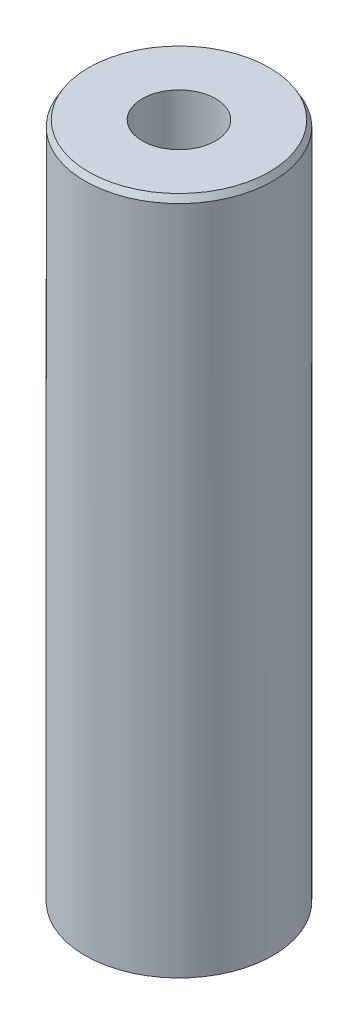
ISO-10303-21;
HEADER;
FILE_DESCRIPTION(('STEP AP214'),'2;1');
FILE_NAME('part.step','',(''),(''),'','','');
FILE_SCHEMA(('AUTOMOTIVE_DESIGN { 1 0 10303 214 1 1 1 1 }'));
ENDSEC;
DATA;
#1=APPLICATION_CONTEXT('core data for automotive mechanical design processes');
#2=APPLICATION_PROTOCOL_DEFINITION('international standard','automotive_design',2000,#1);
#3=PRODUCT_CONTEXT('',#1,'mechanical');
#4=PRODUCT('Part','Part','',(#3));
#5=PRODUCT_RELATED_PRODUCT_CATEGORY('part','',(#4));
#6=PRODUCT_DEFINITION_FORMATION('','',#4);
#7=PRODUCT_DEFINITION_CONTEXT('part definition',#1,'design');
#8=PRODUCT_DEFINITION('design','',#6,#7);
#9=PRODUCT_DEFINITION_SHAPE('','',#8);
#10=(LENGTH_UNIT() NAMED_UNIT(*) SI_UNIT(.MILLI.,.METRE.));
#11=(NAMED_UNIT(*) PLANE_ANGLE_UNIT() SI_UNIT($,.RADIAN.));
#12=(NAMED_UNIT(*) SI_UNIT($,.STERADIAN.) SOLID_ANGLE_UNIT());
#13=UNCERTAINTY_MEASURE_WITH_UNIT(LENGTH_MEASURE(1.E-05),#10,'distance_accuracy_value','');
#14=(GEOMETRIC_REPRESENTATION_CONTEXT(3) GLOBAL_UNCERTAINTY_ASSIGNED_CONTEXT((#13)) GLOBAL_UNIT_ASSIGNED_CONTEXT((#10,
#11,#12)) REPRESENTATION_CONTEXT('',''));
#15=CARTESIAN_POINT('',(0.,0.,0.));
#16=DIRECTION('',(0.,0.,1.));
#17=DIRECTION('',(1.,0.,0.));
#18=AXIS2_PLACEMENT_3D('',#15,#16,#17);
#19=CARTESIAN_POINT('',(0.,181.106623515309,0.));
#20=DIRECTION('',(0.,-1.,0.));
#21=DIRECTION('',(0.,0.,-1.));
#22=AXIS2_PLACEMENT_3D('',#19,#20,#21);
#23=CYLINDRICAL_SURFACE('',#22,25.);
#24=CARTESIAN_POINT('',(0.,179.458389998417,0.));
#25=DIRECTION('',(0.,1.,0.));
#26=DIRECTION('',(0.,0.,1.));
#27=AXIS2_PLACEMENT_3D('',#24,#25,#26);
#28=CIRCLE('',#27,25.);
#29=CARTESIAN_POINT('',(0.,179.458389998417,-25.));
#30=VERTEX_POINT('',#29);
#31=EDGE_CURVE('E50',#30,#30,#28,.F.);
#32=CARTESIAN_POINT('',(0.,0.951608064665238,0.));
#33=DIRECTION('',(0.,1.,0.));
#34=DIRECTION('',(0.,0.,1.));
#35=AXIS2_PLACEMENT_3D('',#32,#33,#34);
#36=CIRCLE('',#35,25.);
#37=CARTESIAN_POINT('',(0.,0.951608064665238,-25.));
#38=VERTEX_POINT('',#37);
#39=EDGE_CURVE('E51',#38,#38,#36,.T.);
#40=CARTESIAN_POINT('',(0.,179.458389998417,-25.));
#41=CARTESIAN_POINT('',(0.,177.598944353274,-25.));
#42=CARTESIAN_POINT('',(0.,175.739498708131,-25.));
#43=CARTESIAN_POINT('',(0.,172.020607417844,-25.));
#44=CARTESIAN_POINT('',(0.,170.161161772701,-25.));
#45=CARTESIAN_POINT('',(0.,166.442270482414,-25.));
#46=CARTESIAN_POINT('',(0.,164.582824837271,-25.));
#47=CARTESIAN_POINT('',(0.,160.863933546985,-25.));
#48=CARTESIAN_POINT('',(0.,159.004487901841,-25.));
#49=CARTESIAN_POINT('',(0.,155.285596611555,-25.));
#50=CARTESIAN_POINT('',(0.,153.426150966412,-25.));
#51=CARTESIAN_POINT('',(0.,149.707259676125,-25.));
#52=CARTESIAN_POINT('',(0.,147.847814030982,-25.));
#53=CARTESIAN_POINT('',(0.,144.128922740695,-25.));
#54=CARTESIAN_POINT('',(0.,142.269477095552,-25.));
#55=CARTESIAN_POINT('',(0.,138.550585805266,-25.));
#56=CARTESIAN_POINT('',(0.,136.691140160122,-25.));
#57=CARTESIAN_POINT('',(0.,132.972248869836,-25.));
#58=CARTESIAN_POINT('',(0.,131.112803224693,-25.));
#59=CARTESIAN_POINT('',(0.,127.393911934406,-25.));
#60=CARTESIAN_POINT('',(0.,125.534466289263,-25.));
#61=CARTESIAN_POINT('',(0.,121.815574998976,-25.));
#62=CARTESIAN_POINT('',(0.,119.956129353833,-25.));
#63=CARTESIAN_POINT('',(0.,116.237238063547,-25.));
#64=CARTESIAN_POINT('',(0.,114.377792418403,-25.));
#65=CARTESIAN_POINT('',(0.,110.658901128117,-25.));
#66=CARTESIAN_POINT('',(0.,108.799455482974,-25.));
#67=CARTESIAN_POINT('',(0.,105.080564192687,-25.));
#68=CARTESIAN_POINT('',(0.,103.221118547544,-25.));
#69=CARTESIAN_POINT('',(0.,99.5022272572574,-25.));
#70=CARTESIAN_POINT('',(0.,97.6427816121142,-25.));
#71=CARTESIAN_POINT('',(0.,93.9238903218277,-25.));
#72=CARTESIAN_POINT('',(0.,92.0644446766844,-25.));
#73=CARTESIAN_POINT('',(0.,88.3455533863979,-25.));
#74=CARTESIAN_POINT('',(0.,86.4861077412547,-25.));
#75=CARTESIAN_POINT('',(0.,82.7672164509682,-25.));
#76=CARTESIAN_POINT('',(0.,80.9077708058249,-25.));
#77=CARTESIAN_POINT('',(0.,77.1888795155384,-25.));
#78=CARTESIAN_POINT('',(0.,75.3294338703952,-25.));
#79=CARTESIAN_POINT('',(0.,71.6105425801087,-25.));
#80=CARTESIAN_POINT('',(0.,69.7510969349654,-25.));
#81=CARTESIAN_POINT('',(0.,66.0322056446789,-25.));
#82=CARTESIAN_POINT('',(0.,64.1727599995357,-25.));
#83=CARTESIAN_POINT('',(0.,60.4538687092492,-25.));
#84=CARTESIAN_POINT('',(0.,58.5944230641059,-25.));
#85=CARTESIAN_POINT('',(0.,54.8755317738194,-25.));
#86=CARTESIAN_POINT('',(0.,53.0160861286762,-25.));
#87=CARTESIAN_POINT('',(0.,49.2971948383897,-25.));
#88=CARTESIAN_POINT('',(0.,47.4377491932464,-25.));
#89=CARTESIAN_POINT('',(0.,43.71885790296,-25.));
#90=CARTESIAN_POINT('',(0.,41.8594122578167,-25.));
#91=CARTESIAN_POINT('',(0.,38.1405209675302,-25.));
#92=CARTESIAN_POINT('',(0.,36.281075322387,-25.));
#93=CARTESIAN_POINT('',(0.,32.5621840321005,-25.));
#94=CARTESIAN_POINT('',(0.,30.7027383869572,-25.));
#95=CARTESIAN_POINT('',(0.,26.9838470966707,-25.));
#96=CARTESIAN_POINT('',(0.,25.1244014515275,-25.));
#97=CARTESIAN_POINT('',(0.,21.405510161241,-25.));
#98=CARTESIAN_POINT('',(0.,19.5460645160977,-25.));
#99=CARTESIAN_POINT('',(0.,15.8271732258112,-25.));
#100=CARTESIAN_POINT('',(0.,13.967727580668,-25.));
#101=CARTESIAN_POINT('',(0.,10.2488362903815,-25.));
#102=CARTESIAN_POINT('',(0.,8.38939064523824,-25.));
#103=CARTESIAN_POINT('',(0.,4.67049935495174,-25.));
#104=CARTESIAN_POINT('',(0.,2.81105370980849,-25.));
#105=CARTESIAN_POINT('',(0.,0.951608064665238,-25.));
#106=B_SPLINE_CURVE_WITH_KNOTS('',3,(#40,#41,#42,#43,#44,#45,#46,#47,#48,#49,#50,#51,#52,#53,
#54,#55,#56,#57,#58,#59,#60,#61,#62,#63,#64,#65,#66,#67,#68,#69,#70,#71,#72,#73,#74,#75,#76,#77,
#78,#79,#80,#81,#82,#83,#84,#85,#86,#87,#88,#89,#90,#91,#92,#93,#94,#95,#96,#97,#98,#99,#100,
#101,#102,#103,#104,#105),.UNSPECIFIED.,.F.,.F.,(4,2,2,2,2,2,2,2,2,2,2,2,2,2,2,2,2,2,2,2,2,2,2,
2,2,2,2,2,2,2,2,2,4),(0.,5.57833693542975,11.1566738708595,16.7350108062893,22.313347741719,
27.8916846771487,33.4700216125785,39.0483585480082,44.626695483438,50.2050324188677,
55.7833693542974,61.3617062897272,66.940043225157,72.5183801605867,78.0967170960164,
83.6750540314462,89.2533909668759,94.8317279023057,100.410064837735,105.988401773165,
111.566738708595,117.145075644025,122.723412579454,128.301749514884,133.880086450314,
139.458423385744,145.036760321173,150.615097256603,156.193434192033,161.771771127463,
167.350108062892,172.928444998322,178.506781933752),.UNSPECIFIED.);
#107=EDGE_CURVE('BSEAM39',#30,#38,#106,.T.);
#108=ORIENTED_EDGE('',*,*,#31,.T.);
#109=ORIENTED_EDGE('',*,*,#39,.T.);
#110=ORIENTED_EDGE('',*,*,#107,.T.);
#111=ORIENTED_EDGE('',*,*,#107,.F.);
#112=EDGE_LOOP('',(#108,#110,#109,#111));
#113=FACE_BOUND('',#112,.T.);
#114=ADVANCED_FACE('F39',(#113),#23,.T.);
#115=CARTESIAN_POINT('',(0.,181.106623515309,0.));
#116=DIRECTION('',(0.,1.,0.));
#117=DIRECTION('',(0.,0.,1.));
#118=AXIS2_PLACEMENT_3D('',#115,#116,#117);
#119=PLANE('',#118);
#120=CARTESIAN_POINT('',(0.,181.106623515309,0.));
#121=DIRECTION('',(0.,1.,0.));
#122=DIRECTION('',(0.,0.,1.));
#123=AXIS2_PLACEMENT_3D('',#120,#121,#122);
#124=CIRCLE('',#123,24.0483919353349);
#125=CARTESIAN_POINT('',(0.,181.106623515309,24.0483919353349));
#126=VERTEX_POINT('',#125);
#127=EDGE_CURVE('E54',#126,#126,#124,.T.);
#128=ORIENTED_EDGE('',*,*,#127,.T.);
#129=EDGE_LOOP('',(#128));
#130=FACE_BOUND('',#129,.T.);
#131=CARTESIAN_POINT('',(0.,181.106623515309,0.));
#132=DIRECTION('',(0.,1.,0.));
#133=DIRECTION('',(0.,0.,1.));
#134=AXIS2_PLACEMENT_3D('',#131,#132,#133);
#135=CIRCLE('',#134,9.75354512604374);
#136=CARTESIAN_POINT('',(0.,181.106623515309,-9.75354512604374));
#137=VERTEX_POINT('',#136);
#138=EDGE_CURVE('E58',#137,#137,#135,.T.);
#139=ORIENTED_EDGE('',*,*,#138,.F.);
#140=EDGE_LOOP('',(#139));
#141=FACE_BOUND('',#140,.T.);
#142=ADVANCED_FACE('F69',(#130,#141),#119,.T.);
#143=CARTESIAN_POINT('',(0.,0.,0.));
#144=DIRECTION('',(0.,1.,0.));
#145=DIRECTION('',(0.,0.,1.));
#146=AXIS2_PLACEMENT_3D('',#143,#144,#145);
#147=PLANE('',#146);
#148=CARTESIAN_POINT('',(0.,0.,0.));
#149=DIRECTION('',(0.,1.,0.));
#150=DIRECTION('',(0.,0.,1.));
#151=AXIS2_PLACEMENT_3D('',#148,#149,#150);
#152=CIRCLE('',#151,23.3517664831075);
#153=CARTESIAN_POINT('',(0.,0.,23.3517664831075));
#154=VERTEX_POINT('',#153);
#155=EDGE_CURVE('E10',#154,#154,#152,.F.);
#156=ORIENTED_EDGE('',*,*,#155,.T.);
#157=EDGE_LOOP('',(#156));
#158=FACE_BOUND('',#157,.T.);
#159=CARTESIAN_POINT('',(0.,0.,0.));
#160=DIRECTION('',(0.,1.,0.));
#161=DIRECTION('',(0.,0.,1.));
#162=AXIS2_PLACEMENT_3D('',#159,#160,#161);
#163=CIRCLE('',#162,9.75354512604374);
#164=CARTESIAN_POINT('',(0.,0.,-9.75354512604374));
#165=VERTEX_POINT('',#164);
#166=EDGE_CURVE('E63',#165,#165,#163,.T.);
#167=ORIENTED_EDGE('',*,*,#166,.T.);
#168=EDGE_LOOP('',(#167));
#169=FACE_BOUND('',#168,.T.);
#170=ADVANCED_FACE('F75',(#158,#169),#147,.F.);
#171=CARTESIAN_POINT('',(0.,181.106623515309,0.));
#172=DIRECTION('',(0.,-1.,0.));
#173=DIRECTION('',(0.,0.,-1.));
#174=AXIS2_PLACEMENT_3D('',#171,#172,#173);
#175=CYLINDRICAL_SURFACE('',#174,9.75354512604374);
#176=CARTESIAN_POINT('',(0.,181.106623515309,-9.75354512604374));
#177=CARTESIAN_POINT('',(0.,179.220096187025,-9.75354512604374));
#178=CARTESIAN_POINT('',(0.,177.33356885874,-9.75354512604374));
#179=CARTESIAN_POINT('',(0.,173.560514202171,-9.75354512604374));
#180=CARTESIAN_POINT('',(0.,171.673986873887,-9.75354512604374));
#181=CARTESIAN_POINT('',(0.,167.900932217318,-9.75354512604374));
#182=CARTESIAN_POINT('',(0.,166.014404889034,-9.75354512604374));
#183=CARTESIAN_POINT('',(0.,162.241350232465,-9.75354512604374));
#184=CARTESIAN_POINT('',(0.,160.35482290418,-9.75354512604374));
#185=CARTESIAN_POINT('',(0.,156.581768247611,-9.75354512604374));
#186=CARTESIAN_POINT('',(0.,154.695240919327,-9.75354512604374));
#187=CARTESIAN_POINT('',(0.,150.922186262758,-9.75354512604374));
#188=CARTESIAN_POINT('',(0.,149.035658934473,-9.75354512604374));
#189=CARTESIAN_POINT('',(0.,145.262604277904,-9.75354512604374));
#190=CARTESIAN_POINT('',(0.,143.37607694962,-9.75354512604374));
#191=CARTESIAN_POINT('',(0.,139.603022293051,-9.75354512604374));
#192=CARTESIAN_POINT('',(0.,137.716494964766,-9.75354512604374));
#193=CARTESIAN_POINT('',(0.,133.943440308197,-9.75354512604374));
#194=CARTESIAN_POINT('',(0.,132.056912979913,-9.75354512604374));
#195=CARTESIAN_POINT('',(0.,128.283858323344,-9.75354512604374));
#196=CARTESIAN_POINT('',(0.,126.39733099506,-9.75354512604374));
#197=CARTESIAN_POINT('',(0.,122.624276338491,-9.75354512604374));
#198=CARTESIAN_POINT('',(0.,120.737749010206,-9.75354512604374));
#199=CARTESIAN_POINT('',(0.,116.964694353637,-9.75354512604374));
#200=CARTESIAN_POINT('',(0.,115.078167025353,-9.75354512604374));
#201=CARTESIAN_POINT('',(0.,111.305112368784,-9.75354512604374));
#202=CARTESIAN_POINT('',(0.,109.418585040499,-9.75354512604374));
#203=CARTESIAN_POINT('',(0.,105.64553038393,-9.75354512604374));
#204=CARTESIAN_POINT('',(0.,103.759003055646,-9.75354512604374));
#205=CARTESIAN_POINT('',(0.,99.985948399077,-9.75354512604374));
#206=CARTESIAN_POINT('',(0.,98.0994210707925,-9.75354512604374));
#207=CARTESIAN_POINT('',(0.,94.3263664142236,-9.75354512604374));
#208=CARTESIAN_POINT('',(0.,92.4398390859391,-9.75354512604374));
#209=CARTESIAN_POINT('',(0.,88.6667844293702,-9.75354512604374));
#210=CARTESIAN_POINT('',(0.,86.7802571010857,-9.75354512604374));
#211=CARTESIAN_POINT('',(0.,83.0072024445168,-9.75354512604374));
#212=CARTESIAN_POINT('',(0.,81.1206751162323,-9.75354512604374));
#213=CARTESIAN_POINT('',(0.,77.3476204596633,-9.75354512604374));
#214=CARTESIAN_POINT('',(0.,75.4610931313789,-9.75354512604374));
#215=CARTESIAN_POINT('',(0.,71.6880384748099,-9.75354512604374));
#216=CARTESIAN_POINT('',(0.,69.8015111465254,-9.75354512604374));
#217=CARTESIAN_POINT('',(0.,66.0284564899565,-9.75354512604374));
#218=CARTESIAN_POINT('',(0.,64.141929161672,-9.75354512604374));
#219=CARTESIAN_POINT('',(0.,60.3688745051031,-9.75354512604374));
#220=CARTESIAN_POINT('',(0.,58.4823471768186,-9.75354512604374));
#221=CARTESIAN_POINT('',(0.,54.7092925202497,-9.75354512604374));
#222=CARTESIAN_POINT('',(0.,52.8227651919652,-9.75354512604374));
#223=CARTESIAN_POINT('',(0.,49.0497105353963,-9.75354512604374));
#224=CARTESIAN_POINT('',(0.,47.1631832071118,-9.75354512604374));
#225=CARTESIAN_POINT('',(0.,43.3901285505428,-9.75354512604374));
#226=CARTESIAN_POINT('',(0.,41.5036012222584,-9.75354512604374));
#227=CARTESIAN_POINT('',(0.,37.7305465656894,-9.75354512604374));
#228=CARTESIAN_POINT('',(0.,35.844019237405,-9.75354512604374));
#229=CARTESIAN_POINT('',(0.,32.070964580836,-9.75354512604374));
#230=CARTESIAN_POINT('',(0.,30.1844372525515,-9.75354512604374));
#231=CARTESIAN_POINT('',(0.,26.4113825959826,-9.75354512604374));
#232=CARTESIAN_POINT('',(0.,24.5248552676981,-9.75354512604374));
#233=CARTESIAN_POINT('',(0.,20.7518006111292,-9.75354512604374));
#234=CARTESIAN_POINT('',(0.,18.8652732828447,-9.75354512604374));
#235=CARTESIAN_POINT('',(0.,15.0922186262758,-9.75354512604374));
#236=CARTESIAN_POINT('',(0.,13.2056912979913,-9.75354512604374));
#237=CARTESIAN_POINT('',(0.,9.43263664142233,-9.75354512604374));
#238=CARTESIAN_POINT('',(0.,7.54610931313786,-9.75354512604374));
#239=CARTESIAN_POINT('',(0.,3.77305465656892,-9.75354512604374));
#240=CARTESIAN_POINT('',(0.,1.88652732828445,-9.75354512604374));
#241=CARTESIAN_POINT('',(0.,0.,-9.75354512604374));
#242=B_SPLINE_CURVE_WITH_KNOTS('',3,(#176,#177,#178,#179,#180,#181,#182,#183,#184,#185,#186,
#187,#188,#189,#190,#191,#192,#193,#194,#195,#196,#197,#198,#199,#200,#201,#202,#203,#204,#205,
#206,#207,#208,#209,#210,#211,#212,#213,#214,#215,#216,#217,#218,#219,#220,#221,#222,#223,#224,
#225,#226,#227,#228,#229,#230,#231,#232,#233,#234,#235,#236,#237,#238,#239,#240,#241),
.UNSPECIFIED.,.F.,.F.,(4,2,2,2,2,2,2,2,2,2,2,2,2,2,2,2,2,2,2,2,2,2,2,2,2,2,2,2,2,2,2,2,4),(0.,
5.65958198485339,11.3191639697068,16.9787459545602,22.6383279394136,28.2979099242671,
33.9574919091205,39.6170738939739,45.2766558788273,50.9362378636807,56.5958198485341,
62.2554018333876,67.914983818241,73.5745658030944,79.2341477879478,84.8937297728012,
90.5533117576546,96.2128937425081,101.872475727361,107.532057712215,113.191639697068,
118.851221681922,124.510803666775,130.170385651629,135.829967636482,141.489549621335,
147.149131606189,152.808713591042,158.468295575896,164.127877560749,169.787459545602,
175.447041530456,181.106623515309),.UNSPECIFIED.);
#243=EDGE_CURVE('BSEAM70',#137,#165,#242,.T.);
#244=ORIENTED_EDGE('',*,*,#138,.T.);
#245=ORIENTED_EDGE('',*,*,#166,.F.);
#246=ORIENTED_EDGE('',*,*,#243,.T.);
#247=ORIENTED_EDGE('',*,*,#243,.F.);
#248=EDGE_LOOP('',(#244,#246,#245,#247));
#249=FACE_BOUND('',#248,.T.);
#250=ADVANCED_FACE('F70',(#249),#175,.F.);
#251=CARTESIAN_POINT('',(0.,181.106623515309,0.));
#252=DIRECTION('',(0.,-1.,0.));
#253=DIRECTION('',(0.,0.,-1.));
#254=AXIS2_PLACEMENT_3D('',#251,#252,#253);
#255=CONICAL_SURFACE('',#254,24.0483919353349,0.523598775598301);
#256=ORIENTED_EDGE('',*,*,#31,.F.);
#257=EDGE_LOOP('',(#256));
#258=FACE_BOUND('',#257,.T.);
#259=ORIENTED_EDGE('',*,*,#127,.F.);
#260=EDGE_LOOP('',(#259));
#261=FACE_BOUND('',#260,.T.);
#262=ADVANCED_FACE('F81',(#258,#261),#255,.T.);
#263=CARTESIAN_POINT('',(0.,0.951608064665238,0.));
#264=DIRECTION('',(0.,1.,0.));
#265=DIRECTION('',(0.,0.,1.));
#266=AXIS2_PLACEMENT_3D('',#263,#264,#265);
#267=CONICAL_SURFACE('',#266,25.,1.04719755119659);
#268=ORIENTED_EDGE('',*,*,#155,.F.);
#269=EDGE_LOOP('',(#268));
#270=FACE_BOUND('',#269,.T.);
#271=ORIENTED_EDGE('',*,*,#39,.F.);
#272=EDGE_LOOP('',(#271));
#273=FACE_BOUND('',#272,.T.);
#274=ADVANCED_FACE('F45',(#270,#273),#267,.T.);
#275=CLOSED_SHELL('',(#114,#142,#170,#250,#262,#274));
#276=MANIFOLD_SOLID_BREP('B2',#275);
#277=ADVANCED_BREP_SHAPE_REPRESENTATION('',(#18,#276),#14);
#278=SHAPE_DEFINITION_REPRESENTATION(#9,#277);
ENDSEC;
END-ISO-10303-21;
